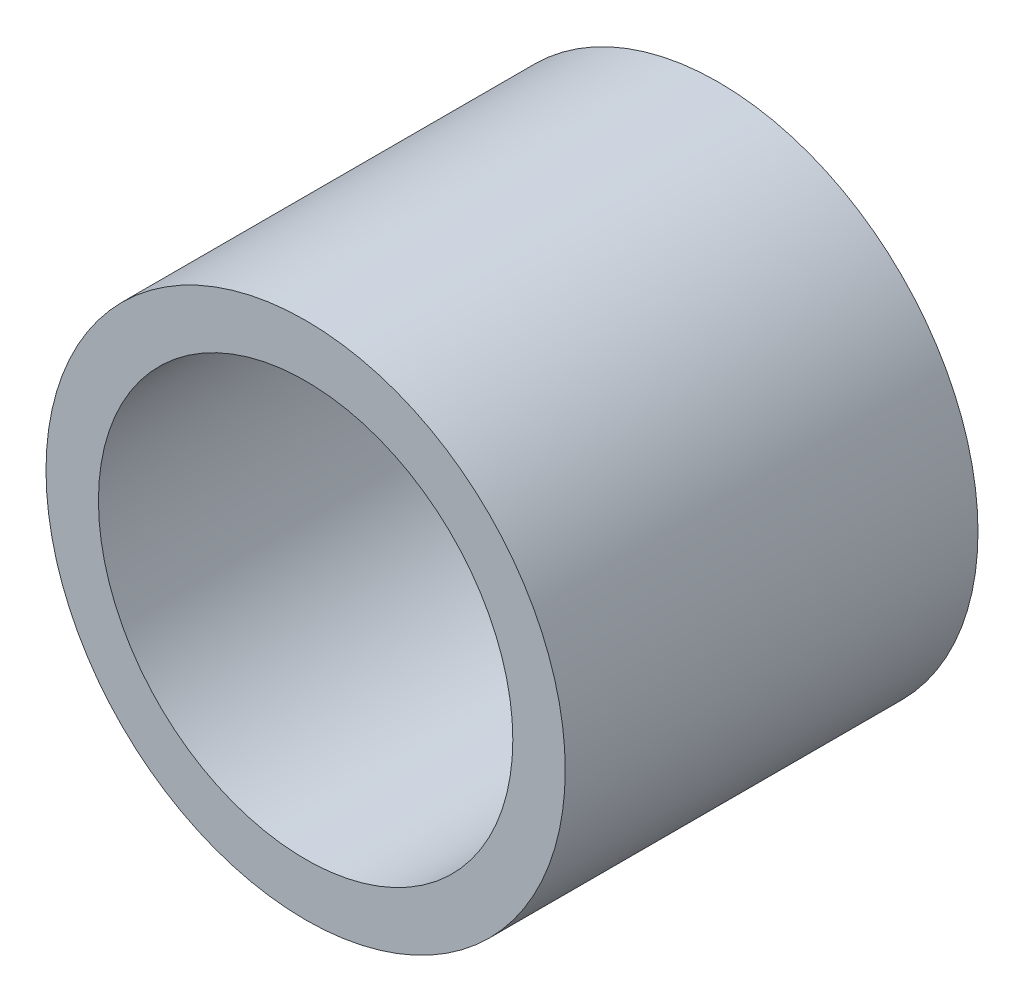
ISO-10303-21;
HEADER;
FILE_DESCRIPTION(('STEP AP214'),'2;1');
FILE_NAME('part.step','',(''),(''),'','','');
FILE_SCHEMA(('AUTOMOTIVE_DESIGN { 1 0 10303 214 1 1 1 1 }'));
ENDSEC;
DATA;
#1=APPLICATION_CONTEXT('core data for automotive mechanical design processes');
#2=APPLICATION_PROTOCOL_DEFINITION('international standard','automotive_design',2000,#1);
#3=PRODUCT_CONTEXT('',#1,'mechanical');
#4=PRODUCT('Part','Part','',(#3));
#5=PRODUCT_RELATED_PRODUCT_CATEGORY('part','',(#4));
#6=PRODUCT_DEFINITION_FORMATION('','',#4);
#7=PRODUCT_DEFINITION_CONTEXT('part definition',#1,'design');
#8=PRODUCT_DEFINITION('design','',#6,#7);
#9=PRODUCT_DEFINITION_SHAPE('','',#8);
#10=(LENGTH_UNIT() NAMED_UNIT(*) SI_UNIT(.MILLI.,.METRE.));
#11=(NAMED_UNIT(*) PLANE_ANGLE_UNIT() SI_UNIT($,.RADIAN.));
#12=(NAMED_UNIT(*) SI_UNIT($,.STERADIAN.) SOLID_ANGLE_UNIT());
#13=UNCERTAINTY_MEASURE_WITH_UNIT(LENGTH_MEASURE(1.E-05),#10,'distance_accuracy_value','');
#14=(GEOMETRIC_REPRESENTATION_CONTEXT(3) GLOBAL_UNCERTAINTY_ASSIGNED_CONTEXT((#13)) GLOBAL_UNIT_ASSIGNED_CONTEXT((#10,
#11,#12)) REPRESENTATION_CONTEXT('',''));
#15=CARTESIAN_POINT('',(0.,0.,0.));
#16=DIRECTION('',(0.,0.,1.));
#17=DIRECTION('',(1.,0.,0.));
#18=AXIS2_PLACEMENT_3D('',#15,#16,#17);
#19=CARTESIAN_POINT('',(0.,0.,3.175));
#20=DIRECTION('',(0.,0.,1.));
#21=DIRECTION('',(1.,0.,0.));
#22=AXIS2_PLACEMENT_3D('',#19,#20,#21);
#23=PLANE('',#22);
#24=CARTESIAN_POINT('',(0.,0.,3.175));
#25=DIRECTION('',(0.,0.,1.));
#26=DIRECTION('',(1.,0.,0.));
#27=AXIS2_PLACEMENT_3D('',#24,#25,#26);
#28=CIRCLE('',#27,3.99415);
#29=CARTESIAN_POINT('',(3.99415,0.,3.175));
#30=VERTEX_POINT('',#29);
#31=EDGE_CURVE('E10',#30,#30,#28,.T.);
#32=ORIENTED_EDGE('',*,*,#31,.T.);
#33=EDGE_LOOP('',(#32));
#34=FACE_BOUND('',#33,.T.);
#35=CARTESIAN_POINT('',(0.,0.,3.175));
#36=DIRECTION('',(0.,0.,1.));
#37=DIRECTION('',(1.,0.,0.));
#38=AXIS2_PLACEMENT_3D('',#35,#36,#37);
#39=CIRCLE('',#38,3.1877);
#40=CARTESIAN_POINT('',(3.1877,0.,3.175));
#41=VERTEX_POINT('',#40);
#42=EDGE_CURVE('E41',#41,#41,#39,.T.);
#43=ORIENTED_EDGE('',*,*,#42,.F.);
#44=EDGE_LOOP('',(#43));
#45=FACE_BOUND('',#44,.T.);
#46=ADVANCED_FACE('F30',(#34,#45),#23,.T.);
#47=CARTESIAN_POINT('',(0.,0.,-3.175));
#48=DIRECTION('',(0.,0.,1.));
#49=DIRECTION('',(1.,0.,0.));
#50=AXIS2_PLACEMENT_3D('',#47,#48,#49);
#51=PLANE('',#50);
#52=CARTESIAN_POINT('',(0.,0.,-3.175));
#53=DIRECTION('',(0.,0.,1.));
#54=DIRECTION('',(1.,0.,0.));
#55=AXIS2_PLACEMENT_3D('',#52,#53,#54);
#56=CIRCLE('',#55,3.99415);
#57=CARTESIAN_POINT('',(3.99415,0.,-3.175));
#58=VERTEX_POINT('',#57);
#59=EDGE_CURVE('E34',#58,#58,#56,.T.);
#60=ORIENTED_EDGE('',*,*,#59,.F.);
#61=EDGE_LOOP('',(#60));
#62=FACE_BOUND('',#61,.T.);
#63=CARTESIAN_POINT('',(0.,0.,-3.175));
#64=DIRECTION('',(0.,0.,1.));
#65=DIRECTION('',(1.,0.,0.));
#66=AXIS2_PLACEMENT_3D('',#63,#64,#65);
#67=CIRCLE('',#66,3.1877);
#68=CARTESIAN_POINT('',(3.1877,0.,-3.175));
#69=VERTEX_POINT('',#68);
#70=EDGE_CURVE('E43',#69,#69,#67,.T.);
#71=ORIENTED_EDGE('',*,*,#70,.T.);
#72=EDGE_LOOP('',(#71));
#73=FACE_BOUND('',#72,.T.);
#74=ADVANCED_FACE('F53',(#62,#73),#51,.F.);
#75=CARTESIAN_POINT('',(0.,0.,3.175));
#76=DIRECTION('',(0.,0.,-1.));
#77=DIRECTION('',(-1.,0.,0.));
#78=AXIS2_PLACEMENT_3D('',#75,#76,#77);
#79=CYLINDRICAL_SURFACE('',#78,3.99415);
#80=ORIENTED_EDGE('',*,*,#31,.F.);
#81=EDGE_LOOP('',(#80));
#82=FACE_BOUND('',#81,.T.);
#83=ORIENTED_EDGE('',*,*,#59,.T.);
#84=EDGE_LOOP('',(#83));
#85=FACE_BOUND('',#84,.T.);
#86=ADVANCED_FACE('F32',(#82,#85),#79,.T.);
#87=CARTESIAN_POINT('',(0.,0.,3.175));
#88=DIRECTION('',(0.,0.,-1.));
#89=DIRECTION('',(-1.,0.,0.));
#90=AXIS2_PLACEMENT_3D('',#87,#88,#89);
#91=CYLINDRICAL_SURFACE('',#90,3.1877);
#92=ORIENTED_EDGE('',*,*,#42,.T.);
#93=EDGE_LOOP('',(#92));
#94=FACE_BOUND('',#93,.T.);
#95=ORIENTED_EDGE('',*,*,#70,.F.);
#96=EDGE_LOOP('',(#95));
#97=FACE_BOUND('',#96,.T.);
#98=ADVANCED_FACE('F49',(#94,#97),#91,.F.);
#99=CLOSED_SHELL('',(#46,#74,#86,#98));
#100=MANIFOLD_SOLID_BREP('B2',#99);
#101=ADVANCED_BREP_SHAPE_REPRESENTATION('',(#18,#100),#14);
#102=SHAPE_DEFINITION_REPRESENTATION(#9,#101);
ENDSEC;
END-ISO-10303-21;
